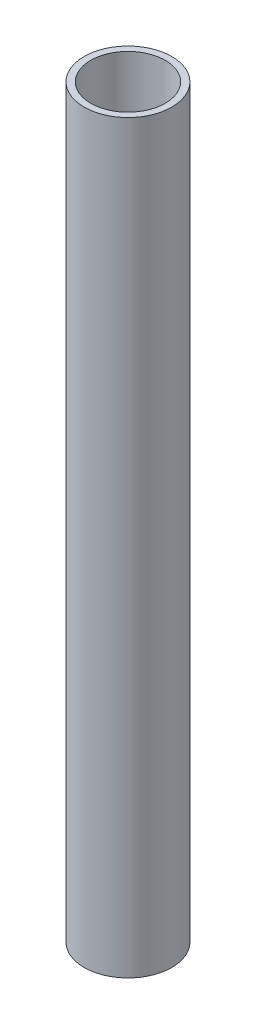
ISO-10303-21;
HEADER;
FILE_DESCRIPTION(('STEP AP214'),'2;1');
FILE_NAME('part.step','',(''),(''),'','','');
FILE_SCHEMA(('AUTOMOTIVE_DESIGN { 1 0 10303 214 1 1 1 1 }'));
ENDSEC;
DATA;
#1=APPLICATION_CONTEXT('core data for automotive mechanical design processes');
#2=APPLICATION_PROTOCOL_DEFINITION('international standard','automotive_design',2000,#1);
#3=PRODUCT_CONTEXT('',#1,'mechanical');
#4=PRODUCT('Part','Part','',(#3));
#5=PRODUCT_RELATED_PRODUCT_CATEGORY('part','',(#4));
#6=PRODUCT_DEFINITION_FORMATION('','',#4);
#7=PRODUCT_DEFINITION_CONTEXT('part definition',#1,'design');
#8=PRODUCT_DEFINITION('design','',#6,#7);
#9=PRODUCT_DEFINITION_SHAPE('','',#8);
#10=(LENGTH_UNIT() NAMED_UNIT(*) SI_UNIT(.MILLI.,.METRE.));
#11=(NAMED_UNIT(*) PLANE_ANGLE_UNIT() SI_UNIT($,.RADIAN.));
#12=(NAMED_UNIT(*) SI_UNIT($,.STERADIAN.) SOLID_ANGLE_UNIT());
#13=UNCERTAINTY_MEASURE_WITH_UNIT(LENGTH_MEASURE(1.E-05),#10,'distance_accuracy_value','');
#14=(GEOMETRIC_REPRESENTATION_CONTEXT(3) GLOBAL_UNCERTAINTY_ASSIGNED_CONTEXT((#13)) GLOBAL_UNIT_ASSIGNED_CONTEXT((#10,
#11,#12)) REPRESENTATION_CONTEXT('',''));
#15=CARTESIAN_POINT('',(0.,0.,0.));
#16=DIRECTION('',(0.,0.,1.));
#17=DIRECTION('',(1.,0.,0.));
#18=AXIS2_PLACEMENT_3D('',#15,#16,#17);
#19=CARTESIAN_POINT('',(0.,215.9,0.));
#20=DIRECTION('',(0.,1.,0.));
#21=DIRECTION('',(0.,0.,1.));
#22=AXIS2_PLACEMENT_3D('',#19,#20,#21);
#23=PLANE('',#22);
#24=CARTESIAN_POINT('',(0.,215.9,0.));
#25=DIRECTION('',(0.,1.,0.));
#26=DIRECTION('',(0.,0.,1.));
#27=AXIS2_PLACEMENT_3D('',#24,#25,#26);
#28=CIRCLE('',#27,12.7);
#29=CARTESIAN_POINT('',(0.,215.9,12.7));
#30=VERTEX_POINT('',#29);
#31=EDGE_CURVE('E10',#30,#30,#28,.T.);
#32=ORIENTED_EDGE('',*,*,#31,.T.);
#33=EDGE_LOOP('',(#32));
#34=FACE_BOUND('',#33,.T.);
#35=CARTESIAN_POINT('',(0.,215.9,0.));
#36=DIRECTION('',(0.,1.,0.));
#37=DIRECTION('',(0.,0.,1.));
#38=AXIS2_PLACEMENT_3D('',#35,#36,#37);
#39=CIRCLE('',#38,10.795);
#40=CARTESIAN_POINT('',(0.,215.9,10.795));
#41=VERTEX_POINT('',#40);
#42=EDGE_CURVE('E50',#41,#41,#39,.T.);
#43=ORIENTED_EDGE('',*,*,#42,.F.);
#44=EDGE_LOOP('',(#43));
#45=FACE_BOUND('',#44,.T.);
#46=ADVANCED_FACE('F37',(#34,#45),#23,.T.);
#47=CARTESIAN_POINT('',(0.,0.,0.));
#48=DIRECTION('',(0.,1.,0.));
#49=DIRECTION('',(0.,0.,1.));
#50=AXIS2_PLACEMENT_3D('',#47,#48,#49);
#51=PLANE('',#50);
#52=CARTESIAN_POINT('',(0.,0.,0.));
#53=DIRECTION('',(0.,1.,0.));
#54=DIRECTION('',(0.,0.,1.));
#55=AXIS2_PLACEMENT_3D('',#52,#53,#54);
#56=CIRCLE('',#55,12.7);
#57=CARTESIAN_POINT('',(0.,0.,12.7));
#58=VERTEX_POINT('',#57);
#59=EDGE_CURVE('E41',#58,#58,#56,.T.);
#60=ORIENTED_EDGE('',*,*,#59,.F.);
#61=EDGE_LOOP('',(#60));
#62=FACE_BOUND('',#61,.T.);
#63=CARTESIAN_POINT('',(0.,0.,0.));
#64=DIRECTION('',(0.,1.,0.));
#65=DIRECTION('',(0.,0.,1.));
#66=AXIS2_PLACEMENT_3D('',#63,#64,#65);
#67=CIRCLE('',#66,10.795);
#68=CARTESIAN_POINT('',(0.,0.,10.795));
#69=VERTEX_POINT('',#68);
#70=EDGE_CURVE('E52',#69,#69,#67,.T.);
#71=ORIENTED_EDGE('',*,*,#70,.T.);
#72=EDGE_LOOP('',(#71));
#73=FACE_BOUND('',#72,.T.);
#74=ADVANCED_FACE('F64',(#62,#73),#51,.F.);
#75=CARTESIAN_POINT('',(0.,215.9,0.));
#76=DIRECTION('',(0.,-1.,0.));
#77=DIRECTION('',(0.,0.,-1.));
#78=AXIS2_PLACEMENT_3D('',#75,#76,#77);
#79=CYLINDRICAL_SURFACE('',#78,12.7);
#80=ORIENTED_EDGE('',*,*,#31,.F.);
#81=EDGE_LOOP('',(#80));
#82=FACE_BOUND('',#81,.T.);
#83=ORIENTED_EDGE('',*,*,#59,.T.);
#84=EDGE_LOOP('',(#83));
#85=FACE_BOUND('',#84,.T.);
#86=ADVANCED_FACE('F39',(#82,#85),#79,.T.);
#87=CARTESIAN_POINT('',(0.,215.9,0.));
#88=DIRECTION('',(0.,-1.,0.));
#89=DIRECTION('',(0.,0.,-1.));
#90=AXIS2_PLACEMENT_3D('',#87,#88,#89);
#91=CYLINDRICAL_SURFACE('',#90,10.795);
#92=ORIENTED_EDGE('',*,*,#42,.T.);
#93=EDGE_LOOP('',(#92));
#94=FACE_BOUND('',#93,.T.);
#95=ORIENTED_EDGE('',*,*,#70,.F.);
#96=EDGE_LOOP('',(#95));
#97=FACE_BOUND('',#96,.T.);
#98=ADVANCED_FACE('F60',(#94,#97),#91,.F.);
#99=CLOSED_SHELL('',(#46,#74,#86,#98));
#100=MANIFOLD_SOLID_BREP('B2',#99);
#101=ADVANCED_BREP_SHAPE_REPRESENTATION('',(#18,#100),#14);
#102=SHAPE_DEFINITION_REPRESENTATION(#9,#101);
ENDSEC;
END-ISO-10303-21;
